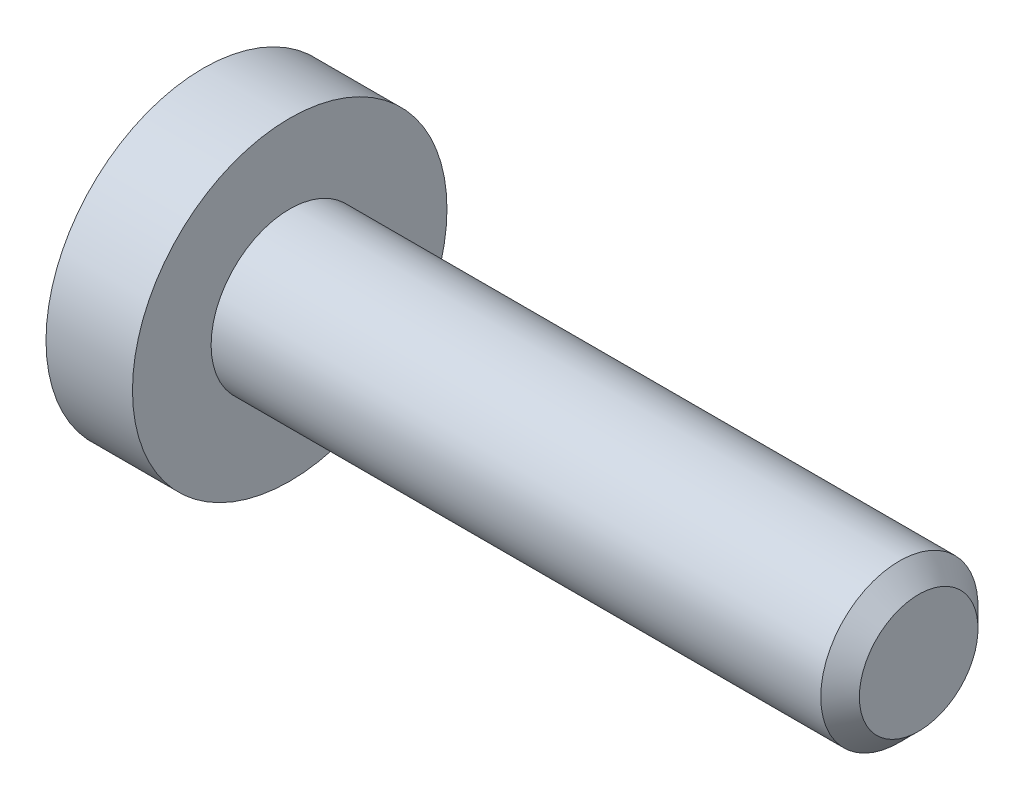
ISO-10303-21;
HEADER;
FILE_DESCRIPTION(('STEP AP214'),'2;1');
FILE_NAME('part.step','',(''),(''),'','','');
FILE_SCHEMA(('AUTOMOTIVE_DESIGN { 1 0 10303 214 1 1 1 1 }'));
ENDSEC;
DATA;
#1=APPLICATION_CONTEXT('core data for automotive mechanical design processes');
#2=APPLICATION_PROTOCOL_DEFINITION('international standard','automotive_design',2000,#1);
#3=PRODUCT_CONTEXT('',#1,'mechanical');
#4=PRODUCT('Part','Part','',(#3));
#5=PRODUCT_RELATED_PRODUCT_CATEGORY('part','',(#4));
#6=PRODUCT_DEFINITION_FORMATION('','',#4);
#7=PRODUCT_DEFINITION_CONTEXT('part definition',#1,'design');
#8=PRODUCT_DEFINITION('design','',#6,#7);
#9=PRODUCT_DEFINITION_SHAPE('','',#8);
#10=(LENGTH_UNIT() NAMED_UNIT(*) SI_UNIT(.MILLI.,.METRE.));
#11=(NAMED_UNIT(*) PLANE_ANGLE_UNIT() SI_UNIT($,.RADIAN.));
#12=(NAMED_UNIT(*) SI_UNIT($,.STERADIAN.) SOLID_ANGLE_UNIT());
#13=UNCERTAINTY_MEASURE_WITH_UNIT(LENGTH_MEASURE(1.E-05),#10,'distance_accuracy_value','');
#14=(GEOMETRIC_REPRESENTATION_CONTEXT(3) GLOBAL_UNCERTAINTY_ASSIGNED_CONTEXT((#13)) GLOBAL_UNIT_ASSIGNED_CONTEXT((#10,
#11,#12)) REPRESENTATION_CONTEXT('',''));
#15=CARTESIAN_POINT('',(0.,0.,0.));
#16=DIRECTION('',(0.,0.,1.));
#17=DIRECTION('',(1.,0.,0.));
#18=AXIS2_PLACEMENT_3D('',#15,#16,#17);
#19=CARTESIAN_POINT('',(-1.1,0.,0.));
#20=DIRECTION('',(1.,0.,0.));
#21=DIRECTION('',(0.,0.,-1.));
#22=AXIS2_PLACEMENT_3D('',#19,#20,#21);
#23=PLANE('',#22);
#24=CARTESIAN_POINT('',(-1.1,0.,0.));
#25=DIRECTION('',(-1.,0.,0.));
#26=DIRECTION('',(0.,0.,1.));
#27=AXIS2_PLACEMENT_3D('',#24,#25,#26);
#28=CIRCLE('',#27,2.);
#29=CARTESIAN_POINT('',(-1.1,0.,2.));
#30=VERTEX_POINT('',#29);
#31=EDGE_CURVE('E11',#30,#30,#28,.T.);
#32=ORIENTED_EDGE('',*,*,#31,.T.);
#33=EDGE_LOOP('',(#32));
#34=FACE_BOUND('',#33,.T.);
#35=DIRECTION('',(0.,-1.,0.));
#36=VECTOR('',#35,1.);
#37=CARTESIAN_POINT('',(-1.1,0.37527767497326,0.65));
#38=LINE('',#37,#36);
#39=CARTESIAN_POINT('',(-1.1,0.37527767497326,0.65));
#40=VERTEX_POINT('',#39);
#41=CARTESIAN_POINT('',(-1.1,-0.37527767497326,0.65));
#42=VERTEX_POINT('',#41);
#43=EDGE_CURVE('E51',#40,#42,#38,.T.);
#44=ORIENTED_EDGE('',*,*,#43,.T.);
#45=DIRECTION('',(0.,-0.499999999999993,-0.866025403784442));
#46=VECTOR('',#45,1.);
#47=CARTESIAN_POINT('',(-1.1,-0.37527767497326,0.65));
#48=LINE('',#47,#46);
#49=CARTESIAN_POINT('',(-1.1,-0.75055534994651,0.));
#50=VERTEX_POINT('',#49);
#51=EDGE_CURVE('E122',#42,#50,#48,.T.);
#52=ORIENTED_EDGE('',*,*,#51,.T.);
#53=DIRECTION('',(0.,0.499999999999993,-0.866025403784442));
#54=VECTOR('',#53,1.);
#55=CARTESIAN_POINT('',(-1.1,-0.75055534994651,0.));
#56=LINE('',#55,#54);
#57=CARTESIAN_POINT('',(-1.1,-0.37527767497326,-0.65));
#58=VERTEX_POINT('',#57);
#59=EDGE_CURVE('E125',#50,#58,#56,.T.);
#60=ORIENTED_EDGE('',*,*,#59,.T.);
#61=DIRECTION('',(0.,1.,0.));
#62=VECTOR('',#61,1.);
#63=CARTESIAN_POINT('',(-1.1,-0.37527767497326,-0.65));
#64=LINE('',#63,#62);
#65=CARTESIAN_POINT('',(-1.1,0.37527767497326,-0.65));
#66=VERTEX_POINT('',#65);
#67=EDGE_CURVE('E128',#58,#66,#64,.T.);
#68=ORIENTED_EDGE('',*,*,#67,.T.);
#69=DIRECTION('',(0.,0.499999999999993,0.866025403784442));
#70=VECTOR('',#69,1.);
#71=CARTESIAN_POINT('',(-1.1,0.37527767497326,-0.65));
#72=LINE('',#71,#70);
#73=CARTESIAN_POINT('',(-1.1,0.75055534994651,0.));
#74=VERTEX_POINT('',#73);
#75=EDGE_CURVE('E112',#66,#74,#72,.T.);
#76=ORIENTED_EDGE('',*,*,#75,.T.);
#77=DIRECTION('',(0.,-0.499999999999993,0.866025403784442));
#78=VECTOR('',#77,1.);
#79=CARTESIAN_POINT('',(-1.1,0.75055534994651,0.));
#80=LINE('',#79,#78);
#81=EDGE_CURVE('E131',#74,#40,#80,.T.);
#82=ORIENTED_EDGE('',*,*,#81,.T.);
#83=EDGE_LOOP('',(#44,#52,#60,#68,#76,#82));
#84=FACE_BOUND('',#83,.T.);
#85=ADVANCED_FACE('F37',(#34,#84),#23,.F.);
#86=CARTESIAN_POINT('',(8.,0.,0.));
#87=DIRECTION('',(-1.,0.,0.));
#88=DIRECTION('',(0.,0.,1.));
#89=AXIS2_PLACEMENT_3D('',#86,#87,#88);
#90=CYLINDRICAL_SURFACE('',#89,2.);
#91=ORIENTED_EDGE('',*,*,#31,.F.);
#92=EDGE_LOOP('',(#91));
#93=FACE_BOUND('',#92,.T.);
#94=CARTESIAN_POINT('',(0.,0.,0.));
#95=DIRECTION('',(-1.,0.,0.));
#96=DIRECTION('',(0.,0.,1.));
#97=AXIS2_PLACEMENT_3D('',#94,#95,#96);
#98=CIRCLE('',#97,2.);
#99=CARTESIAN_POINT('',(0.,0.,2.));
#100=VERTEX_POINT('',#99);
#101=EDGE_CURVE('E44',#100,#100,#98,.T.);
#102=ORIENTED_EDGE('',*,*,#101,.T.);
#103=EDGE_LOOP('',(#102));
#104=FACE_BOUND('',#103,.T.);
#105=ADVANCED_FACE('F153',(#93,#104),#90,.T.);
#106=CARTESIAN_POINT('',(0.,2.,0.));
#107=DIRECTION('',(-1.,0.,0.));
#108=DIRECTION('',(0.,0.,1.));
#109=AXIS2_PLACEMENT_3D('',#106,#107,#108);
#110=PLANE('',#109);
#111=ORIENTED_EDGE('',*,*,#101,.F.);
#112=EDGE_LOOP('',(#111));
#113=FACE_BOUND('',#112,.T.);
#114=CARTESIAN_POINT('',(0.,0.,0.));
#115=DIRECTION('',(-1.,0.,0.));
#116=DIRECTION('',(0.,0.,1.));
#117=AXIS2_PLACEMENT_3D('',#114,#115,#116);
#118=CIRCLE('',#117,1.);
#119=CARTESIAN_POINT('',(0.,0.,1.));
#120=VERTEX_POINT('',#119);
#121=EDGE_CURVE('E148',#120,#120,#118,.T.);
#122=ORIENTED_EDGE('',*,*,#121,.T.);
#123=EDGE_LOOP('',(#122));
#124=FACE_BOUND('',#123,.T.);
#125=ADVANCED_FACE('F155',(#113,#124),#110,.F.);
#126=CARTESIAN_POINT('',(8.,0.,0.));
#127=DIRECTION('',(-1.,0.,0.));
#128=DIRECTION('',(0.,0.,1.));
#129=AXIS2_PLACEMENT_3D('',#126,#127,#128);
#130=CYLINDRICAL_SURFACE('',#129,1.);
#131=ORIENTED_EDGE('',*,*,#121,.F.);
#132=EDGE_LOOP('',(#131));
#133=FACE_BOUND('',#132,.T.);
#134=CARTESIAN_POINT('',(7.7545,0.,0.));
#135=DIRECTION('',(-1.,0.,0.));
#136=DIRECTION('',(0.,0.,1.));
#137=AXIS2_PLACEMENT_3D('',#134,#135,#136);
#138=CIRCLE('',#137,1.);
#139=CARTESIAN_POINT('',(7.7545,0.,1.));
#140=VERTEX_POINT('',#139);
#141=EDGE_CURVE('E145',#140,#140,#138,.T.);
#142=ORIENTED_EDGE('',*,*,#141,.T.);
#143=EDGE_LOOP('',(#142));
#144=FACE_BOUND('',#143,.T.);
#145=ADVANCED_FACE('F158',(#133,#144),#130,.T.);
#146=CARTESIAN_POINT('',(8.,0.,0.));
#147=DIRECTION('',(-1.,0.,0.));
#148=DIRECTION('',(0.,0.,1.));
#149=AXIS2_PLACEMENT_3D('',#146,#147,#148);
#150=CONICAL_SURFACE('',#149,0.7545,0.785398163397448);
#151=ORIENTED_EDGE('',*,*,#141,.F.);
#152=EDGE_LOOP('',(#151));
#153=FACE_BOUND('',#152,.T.);
#154=CARTESIAN_POINT('',(8.,0.,0.));
#155=DIRECTION('',(-1.,0.,0.));
#156=DIRECTION('',(0.,0.,1.));
#157=AXIS2_PLACEMENT_3D('',#154,#155,#156);
#158=CIRCLE('',#157,0.7545);
#159=CARTESIAN_POINT('',(8.,0.,0.7545));
#160=VERTEX_POINT('',#159);
#161=EDGE_CURVE('E142',#160,#160,#158,.T.);
#162=ORIENTED_EDGE('',*,*,#161,.T.);
#163=EDGE_LOOP('',(#162));
#164=FACE_BOUND('',#163,.T.);
#165=ADVANCED_FACE('F164',(#153,#164),#150,.T.);
#166=CARTESIAN_POINT('',(8.,0.7545,0.));
#167=DIRECTION('',(-1.,0.,0.));
#168=DIRECTION('',(0.,0.,1.));
#169=AXIS2_PLACEMENT_3D('',#166,#167,#168);
#170=PLANE('',#169);
#171=ORIENTED_EDGE('',*,*,#161,.F.);
#172=EDGE_LOOP('',(#171));
#173=FACE_BOUND('',#172,.T.);
#174=ADVANCED_FACE('F170',(#173),#170,.F.);
#175=CARTESIAN_POINT('',(0.0999999999999998,0.37527767497326,0.65));
#176=DIRECTION('',(0.,0.,-1.));
#177=DIRECTION('',(-1.,0.,0.));
#178=AXIS2_PLACEMENT_3D('',#175,#176,#177);
#179=PLANE('',#178);
#180=ORIENTED_EDGE('',*,*,#43,.F.);
#181=DIRECTION('',(-1.,0.,0.));
#182=VECTOR('',#181,1.);
#183=CARTESIAN_POINT('',(0.0999999999999998,0.37527767497326,0.65));
#184=LINE('',#183,#182);
#185=CARTESIAN_POINT('',(0.0999999999999998,0.37527767497326,0.65));
#186=VERTEX_POINT('',#185);
#187=EDGE_CURVE('E117',#186,#40,#184,.T.);
#188=ORIENTED_EDGE('',*,*,#187,.F.);
#189=DIRECTION('',(0.,-1.,0.));
#190=VECTOR('',#189,1.);
#191=CARTESIAN_POINT('',(0.0999999999999998,0.37527767497326,0.65));
#192=LINE('',#191,#190);
#193=CARTESIAN_POINT('',(0.0999999999999998,-0.37527767497326,0.65));
#194=VERTEX_POINT('',#193);
#195=EDGE_CURVE('E134',#186,#194,#192,.T.);
#196=ORIENTED_EDGE('',*,*,#195,.T.);
#197=DIRECTION('',(-1.,0.,0.));
#198=VECTOR('',#197,1.);
#199=CARTESIAN_POINT('',(0.0999999999999998,-0.37527767497326,0.65));
#200=LINE('',#199,#198);
#201=EDGE_CURVE('E140',#194,#42,#200,.T.);
#202=ORIENTED_EDGE('',*,*,#201,.T.);
#203=EDGE_LOOP('',(#180,#188,#196,#202));
#204=FACE_BOUND('',#203,.T.);
#205=ADVANCED_FACE('F175',(#204),#179,.T.);
#206=CARTESIAN_POINT('',(0.0999999999999998,-0.37527767497326,0.65));
#207=DIRECTION('',(0.,0.866025403784443,-0.499999999999993));
#208=DIRECTION('',(0.,0.499999999999993,0.866025403784442));
#209=AXIS2_PLACEMENT_3D('',#206,#207,#208);
#210=PLANE('',#209);
#211=ORIENTED_EDGE('',*,*,#51,.F.);
#212=ORIENTED_EDGE('',*,*,#201,.F.);
#213=DIRECTION('',(0.,-0.499999999999993,-0.866025403784442));
#214=VECTOR('',#213,1.);
#215=CARTESIAN_POINT('',(0.0999999999999998,-0.37527767497326,0.65));
#216=LINE('',#215,#214);
#217=CARTESIAN_POINT('',(0.0999999999999998,-0.75055534994651,0.));
#218=VERTEX_POINT('',#217);
#219=EDGE_CURVE('E90',#194,#218,#216,.T.);
#220=ORIENTED_EDGE('',*,*,#219,.T.);
#221=DIRECTION('',(-1.,0.,0.));
#222=VECTOR('',#221,1.);
#223=CARTESIAN_POINT('',(0.0999999999999998,-0.75055534994651,0.));
#224=LINE('',#223,#222);
#225=EDGE_CURVE('E138',#218,#50,#224,.T.);
#226=ORIENTED_EDGE('',*,*,#225,.T.);
#227=EDGE_LOOP('',(#211,#212,#220,#226));
#228=FACE_BOUND('',#227,.T.);
#229=ADVANCED_FACE('F180',(#228),#210,.T.);
#230=CARTESIAN_POINT('',(0.0999999999999998,-0.75055534994651,0.));
#231=DIRECTION('',(0.,0.866025403784443,0.499999999999993));
#232=DIRECTION('',(0.,-0.499999999999993,0.866025403784442));
#233=AXIS2_PLACEMENT_3D('',#230,#231,#232);
#234=PLANE('',#233);
#235=ORIENTED_EDGE('',*,*,#59,.F.);
#236=ORIENTED_EDGE('',*,*,#225,.F.);
#237=DIRECTION('',(0.,0.499999999999993,-0.866025403784442));
#238=VECTOR('',#237,1.);
#239=CARTESIAN_POINT('',(0.0999999999999998,-0.75055534994651,0.));
#240=LINE('',#239,#238);
#241=CARTESIAN_POINT('',(0.0999999999999998,-0.37527767497326,-0.65));
#242=VERTEX_POINT('',#241);
#243=EDGE_CURVE('E108',#218,#242,#240,.T.);
#244=ORIENTED_EDGE('',*,*,#243,.T.);
#245=DIRECTION('',(-1.,0.,0.));
#246=VECTOR('',#245,1.);
#247=CARTESIAN_POINT('',(0.0999999999999998,-0.37527767497326,-0.65));
#248=LINE('',#247,#246);
#249=EDGE_CURVE('E105',#242,#58,#248,.T.);
#250=ORIENTED_EDGE('',*,*,#249,.T.);
#251=EDGE_LOOP('',(#235,#236,#244,#250));
#252=FACE_BOUND('',#251,.T.);
#253=ADVANCED_FACE('F197',(#252),#234,.T.);
#254=CARTESIAN_POINT('',(0.0999999999999998,-0.37527767497326,-0.65));
#255=DIRECTION('',(0.,0.,1.));
#256=DIRECTION('',(1.,0.,0.));
#257=AXIS2_PLACEMENT_3D('',#254,#255,#256);
#258=PLANE('',#257);
#259=ORIENTED_EDGE('',*,*,#67,.F.);
#260=ORIENTED_EDGE('',*,*,#249,.F.);
#261=DIRECTION('',(0.,1.,0.));
#262=VECTOR('',#261,1.);
#263=CARTESIAN_POINT('',(0.0999999999999998,-0.37527767497326,-0.65));
#264=LINE('',#263,#262);
#265=CARTESIAN_POINT('',(0.0999999999999998,0.37527767497326,-0.65));
#266=VERTEX_POINT('',#265);
#267=EDGE_CURVE('E100',#242,#266,#264,.T.);
#268=ORIENTED_EDGE('',*,*,#267,.T.);
#269=DIRECTION('',(-1.,0.,0.));
#270=VECTOR('',#269,1.);
#271=CARTESIAN_POINT('',(0.0999999999999998,0.37527767497326,-0.65));
#272=LINE('',#271,#270);
#273=EDGE_CURVE('E104',#266,#66,#272,.T.);
#274=ORIENTED_EDGE('',*,*,#273,.T.);
#275=EDGE_LOOP('',(#259,#260,#268,#274));
#276=FACE_BOUND('',#275,.T.);
#277=ADVANCED_FACE('F103',(#276),#258,.T.);
#278=CARTESIAN_POINT('',(0.0999999999999998,0.37527767497326,-0.65));
#279=DIRECTION('',(0.,-0.866025403784443,0.499999999999993));
#280=DIRECTION('',(0.,-0.499999999999993,-0.866025403784442));
#281=AXIS2_PLACEMENT_3D('',#278,#279,#280);
#282=PLANE('',#281);
#283=ORIENTED_EDGE('',*,*,#75,.F.);
#284=ORIENTED_EDGE('',*,*,#273,.F.);
#285=DIRECTION('',(0.,0.499999999999993,0.866025403784442));
#286=VECTOR('',#285,1.);
#287=CARTESIAN_POINT('',(0.0999999999999998,0.37527767497326,-0.65));
#288=LINE('',#287,#286);
#289=CARTESIAN_POINT('',(0.0999999999999998,0.75055534994651,0.));
#290=VERTEX_POINT('',#289);
#291=EDGE_CURVE('E107',#266,#290,#288,.T.);
#292=ORIENTED_EDGE('',*,*,#291,.T.);
#293=DIRECTION('',(-1.,0.,0.));
#294=VECTOR('',#293,1.);
#295=CARTESIAN_POINT('',(0.0999999999999998,0.75055534994651,0.));
#296=LINE('',#295,#294);
#297=EDGE_CURVE('E81',#290,#74,#296,.T.);
#298=ORIENTED_EDGE('',*,*,#297,.T.);
#299=EDGE_LOOP('',(#283,#284,#292,#298));
#300=FACE_BOUND('',#299,.T.);
#301=ADVANCED_FACE('F110',(#300),#282,.T.);
#302=CARTESIAN_POINT('',(0.0999999999999998,0.75055534994651,0.));
#303=DIRECTION('',(0.,-0.866025403784443,-0.499999999999993));
#304=DIRECTION('',(0.,0.499999999999993,-0.866025403784442));
#305=AXIS2_PLACEMENT_3D('',#302,#303,#304);
#306=PLANE('',#305);
#307=ORIENTED_EDGE('',*,*,#81,.F.);
#308=ORIENTED_EDGE('',*,*,#297,.F.);
#309=DIRECTION('',(0.,-0.499999999999993,0.866025403784442));
#310=VECTOR('',#309,1.);
#311=CARTESIAN_POINT('',(0.0999999999999998,0.75055534994651,0.));
#312=LINE('',#311,#310);
#313=EDGE_CURVE('E59',#290,#186,#312,.T.);
#314=ORIENTED_EDGE('',*,*,#313,.T.);
#315=ORIENTED_EDGE('',*,*,#187,.T.);
#316=EDGE_LOOP('',(#307,#308,#314,#315));
#317=FACE_BOUND('',#316,.T.);
#318=ADVANCED_FACE('F190',(#317),#306,.T.);
#319=CARTESIAN_POINT('',(0.0999999999999998,0.,0.));
#320=DIRECTION('',(1.,0.,0.));
#321=DIRECTION('',(0.,0.,-1.));
#322=AXIS2_PLACEMENT_3D('',#319,#320,#321);
#323=PLANE('',#322);
#324=ORIENTED_EDGE('',*,*,#195,.F.);
#325=ORIENTED_EDGE('',*,*,#313,.F.);
#326=ORIENTED_EDGE('',*,*,#291,.F.);
#327=ORIENTED_EDGE('',*,*,#267,.F.);
#328=ORIENTED_EDGE('',*,*,#243,.F.);
#329=ORIENTED_EDGE('',*,*,#219,.F.);
#330=EDGE_LOOP('',(#324,#325,#326,#327,#328,#329));
#331=FACE_BOUND('',#330,.T.);
#332=ADVANCED_FACE('F115',(#331),#323,.F.);
#333=CLOSED_SHELL('',(#85,#105,#125,#145,#165,#174,#205,#229,#253,#277,#301,#318,#332));
#334=MANIFOLD_SOLID_BREP('B2',#333);
#335=ADVANCED_BREP_SHAPE_REPRESENTATION('',(#18,#334),#14);
#336=SHAPE_DEFINITION_REPRESENTATION(#9,#335);
ENDSEC;
END-ISO-10303-21;
